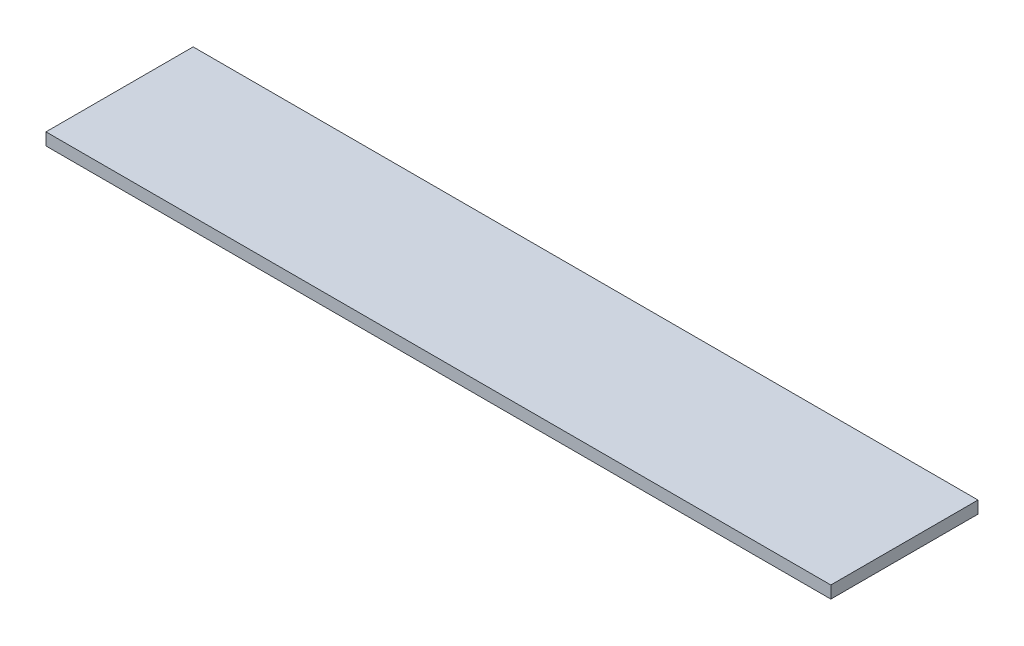
ISO-10303-21;
HEADER;
FILE_DESCRIPTION(('STEP AP214'),'2;1');
FILE_NAME('part.step','',(''),(''),'','','');
FILE_SCHEMA(('AUTOMOTIVE_DESIGN { 1 0 10303 214 1 1 1 1 }'));
ENDSEC;
DATA;
#1=APPLICATION_CONTEXT('core data for automotive mechanical design processes');
#2=APPLICATION_PROTOCOL_DEFINITION('international standard','automotive_design',2000,#1);
#3=PRODUCT_CONTEXT('',#1,'mechanical');
#4=PRODUCT('Part','Part','',(#3));
#5=PRODUCT_RELATED_PRODUCT_CATEGORY('part','',(#4));
#6=PRODUCT_DEFINITION_FORMATION('','',#4);
#7=PRODUCT_DEFINITION_CONTEXT('part definition',#1,'design');
#8=PRODUCT_DEFINITION('design','',#6,#7);
#9=PRODUCT_DEFINITION_SHAPE('','',#8);
#10=(LENGTH_UNIT() NAMED_UNIT(*) SI_UNIT(.MILLI.,.METRE.));
#11=(NAMED_UNIT(*) PLANE_ANGLE_UNIT() SI_UNIT($,.RADIAN.));
#12=(NAMED_UNIT(*) SI_UNIT($,.STERADIAN.) SOLID_ANGLE_UNIT());
#13=UNCERTAINTY_MEASURE_WITH_UNIT(LENGTH_MEASURE(1.E-05),#10,'distance_accuracy_value','');
#14=(GEOMETRIC_REPRESENTATION_CONTEXT(3) GLOBAL_UNCERTAINTY_ASSIGNED_CONTEXT((#13)) GLOBAL_UNIT_ASSIGNED_CONTEXT((#10,
#11,#12)) REPRESENTATION_CONTEXT('',''));
#15=CARTESIAN_POINT('',(0.,0.,0.));
#16=DIRECTION('',(0.,0.,1.));
#17=DIRECTION('',(1.,0.,0.));
#18=AXIS2_PLACEMENT_3D('',#15,#16,#17);
#19=CARTESIAN_POINT('',(0.,6.35,0.));
#20=DIRECTION('',(1.,0.,0.));
#21=DIRECTION('',(0.,0.,1.));
#22=AXIS2_PLACEMENT_3D('',#19,#20,#21);
#23=PLANE('',#22);
#24=DIRECTION('',(0.,0.,-1.));
#25=VECTOR('',#24,1.);
#26=CARTESIAN_POINT('',(0.,0.,0.));
#27=LINE('',#26,#25);
#28=CARTESIAN_POINT('',(0.,0.,76.2));
#29=VERTEX_POINT('',#28);
#30=CARTESIAN_POINT('',(0.,0.,0.));
#31=VERTEX_POINT('',#30);
#32=EDGE_CURVE('E113',#29,#31,#27,.T.);
#33=ORIENTED_EDGE('',*,*,#32,.F.);
#34=DIRECTION('',(0.,-1.,0.));
#35=VECTOR('',#34,1.);
#36=CARTESIAN_POINT('',(0.,6.35,76.2));
#37=LINE('',#36,#35);
#38=CARTESIAN_POINT('',(0.,6.35,76.2));
#39=VERTEX_POINT('',#38);
#40=EDGE_CURVE('E112',#39,#29,#37,.T.);
#41=ORIENTED_EDGE('',*,*,#40,.F.);
#42=DIRECTION('',(0.,0.,-1.));
#43=VECTOR('',#42,1.);
#44=CARTESIAN_POINT('',(0.,6.35,0.));
#45=LINE('',#44,#43);
#46=CARTESIAN_POINT('',(0.,6.35,0.));
#47=VERTEX_POINT('',#46);
#48=EDGE_CURVE('E104',#39,#47,#45,.T.);
#49=ORIENTED_EDGE('',*,*,#48,.T.);
#50=DIRECTION('',(0.,-1.,0.));
#51=VECTOR('',#50,1.);
#52=CARTESIAN_POINT('',(0.,6.35,0.));
#53=LINE('',#52,#51);
#54=EDGE_CURVE('E11',#47,#31,#53,.T.);
#55=ORIENTED_EDGE('',*,*,#54,.T.);
#56=EDGE_LOOP('',(#33,#41,#49,#55));
#57=FACE_BOUND('',#56,.T.);
#58=ADVANCED_FACE('F43',(#57),#23,.F.);
#59=CARTESIAN_POINT('',(0.,6.35,0.));
#60=DIRECTION('',(0.,0.,1.));
#61=DIRECTION('',(-1.,0.,0.));
#62=AXIS2_PLACEMENT_3D('',#59,#60,#61);
#63=PLANE('',#62);
#64=DIRECTION('',(1.,0.,0.));
#65=VECTOR('',#64,1.);
#66=CARTESIAN_POINT('',(0.,0.,0.));
#67=LINE('',#66,#65);
#68=CARTESIAN_POINT('',(406.4,0.,0.));
#69=VERTEX_POINT('',#68);
#70=EDGE_CURVE('E116',#31,#69,#67,.T.);
#71=ORIENTED_EDGE('',*,*,#70,.F.);
#72=ORIENTED_EDGE('',*,*,#54,.F.);
#73=DIRECTION('',(1.,0.,0.));
#74=VECTOR('',#73,1.);
#75=CARTESIAN_POINT('',(0.,6.35,0.));
#76=LINE('',#75,#74);
#77=CARTESIAN_POINT('',(406.4,6.35,0.));
#78=VERTEX_POINT('',#77);
#79=EDGE_CURVE('E85',#47,#78,#76,.T.);
#80=ORIENTED_EDGE('',*,*,#79,.T.);
#81=DIRECTION('',(0.,-1.,0.));
#82=VECTOR('',#81,1.);
#83=CARTESIAN_POINT('',(406.4,6.35,0.));
#84=LINE('',#83,#82);
#85=EDGE_CURVE('E52',#78,#69,#84,.T.);
#86=ORIENTED_EDGE('',*,*,#85,.T.);
#87=EDGE_LOOP('',(#71,#72,#80,#86));
#88=FACE_BOUND('',#87,.T.);
#89=ADVANCED_FACE('F101',(#88),#63,.F.);
#90=CARTESIAN_POINT('',(406.4,6.35,0.));
#91=DIRECTION('',(-1.,0.,0.));
#92=DIRECTION('',(0.,0.,-1.));
#93=AXIS2_PLACEMENT_3D('',#90,#91,#92);
#94=PLANE('',#93);
#95=DIRECTION('',(0.,0.,1.));
#96=VECTOR('',#95,1.);
#97=CARTESIAN_POINT('',(406.4,0.,0.));
#98=LINE('',#97,#96);
#99=CARTESIAN_POINT('',(406.4,0.,76.2));
#100=VERTEX_POINT('',#99);
#101=EDGE_CURVE('E96',#69,#100,#98,.T.);
#102=ORIENTED_EDGE('',*,*,#101,.F.);
#103=ORIENTED_EDGE('',*,*,#85,.F.);
#104=DIRECTION('',(0.,0.,1.));
#105=VECTOR('',#104,1.);
#106=CARTESIAN_POINT('',(406.4,6.35,0.));
#107=LINE('',#106,#105);
#108=CARTESIAN_POINT('',(406.4,6.35,76.2));
#109=VERTEX_POINT('',#108);
#110=EDGE_CURVE('E88',#78,#109,#107,.T.);
#111=ORIENTED_EDGE('',*,*,#110,.T.);
#112=DIRECTION('',(0.,-1.,0.));
#113=VECTOR('',#112,1.);
#114=CARTESIAN_POINT('',(406.4,6.35,76.2));
#115=LINE('',#114,#113);
#116=EDGE_CURVE('E100',#109,#100,#115,.T.);
#117=ORIENTED_EDGE('',*,*,#116,.T.);
#118=EDGE_LOOP('',(#102,#103,#111,#117));
#119=FACE_BOUND('',#118,.T.);
#120=ADVANCED_FACE('F95',(#119),#94,.F.);
#121=CARTESIAN_POINT('',(0.,6.35,76.2));
#122=DIRECTION('',(0.,0.,-1.));
#123=DIRECTION('',(1.,0.,0.));
#124=AXIS2_PLACEMENT_3D('',#121,#122,#123);
#125=PLANE('',#124);
#126=DIRECTION('',(-1.,0.,0.));
#127=VECTOR('',#126,1.);
#128=CARTESIAN_POINT('',(0.,0.,76.2));
#129=LINE('',#128,#127);
#130=EDGE_CURVE('E74',#100,#29,#129,.T.);
#131=ORIENTED_EDGE('',*,*,#130,.F.);
#132=ORIENTED_EDGE('',*,*,#116,.F.);
#133=DIRECTION('',(-1.,0.,0.));
#134=VECTOR('',#133,1.);
#135=CARTESIAN_POINT('',(0.,6.35,76.2));
#136=LINE('',#135,#134);
#137=EDGE_CURVE('E60',#109,#39,#136,.T.);
#138=ORIENTED_EDGE('',*,*,#137,.T.);
#139=ORIENTED_EDGE('',*,*,#40,.T.);
#140=EDGE_LOOP('',(#131,#132,#138,#139));
#141=FACE_BOUND('',#140,.T.);
#142=ADVANCED_FACE('F129',(#141),#125,.F.);
#143=CARTESIAN_POINT('',(0.,6.35,0.));
#144=DIRECTION('',(0.,-1.,0.));
#145=DIRECTION('',(0.,0.,1.));
#146=AXIS2_PLACEMENT_3D('',#143,#144,#145);
#147=PLANE('',#146);
#148=ORIENTED_EDGE('',*,*,#48,.F.);
#149=ORIENTED_EDGE('',*,*,#137,.F.);
#150=ORIENTED_EDGE('',*,*,#110,.F.);
#151=ORIENTED_EDGE('',*,*,#79,.F.);
#152=EDGE_LOOP('',(#148,#149,#150,#151));
#153=FACE_BOUND('',#152,.T.);
#154=ADVANCED_FACE('F90',(#153),#147,.F.);
#155=CARTESIAN_POINT('',(0.,0.,0.));
#156=DIRECTION('',(0.,-1.,0.));
#157=DIRECTION('',(0.,0.,1.));
#158=AXIS2_PLACEMENT_3D('',#155,#156,#157);
#159=PLANE('',#158);
#160=ORIENTED_EDGE('',*,*,#32,.T.);
#161=ORIENTED_EDGE('',*,*,#70,.T.);
#162=ORIENTED_EDGE('',*,*,#101,.T.);
#163=ORIENTED_EDGE('',*,*,#130,.T.);
#164=EDGE_LOOP('',(#160,#161,#162,#163));
#165=FACE_BOUND('',#164,.T.);
#166=ADVANCED_FACE('F125',(#165),#159,.T.);
#167=CLOSED_SHELL('',(#58,#89,#120,#142,#154,#166));
#168=MANIFOLD_SOLID_BREP('B2',#167);
#169=ADVANCED_BREP_SHAPE_REPRESENTATION('',(#18,#168),#14);
#170=SHAPE_DEFINITION_REPRESENTATION(#9,#169);
ENDSEC;
END-ISO-10303-21;
